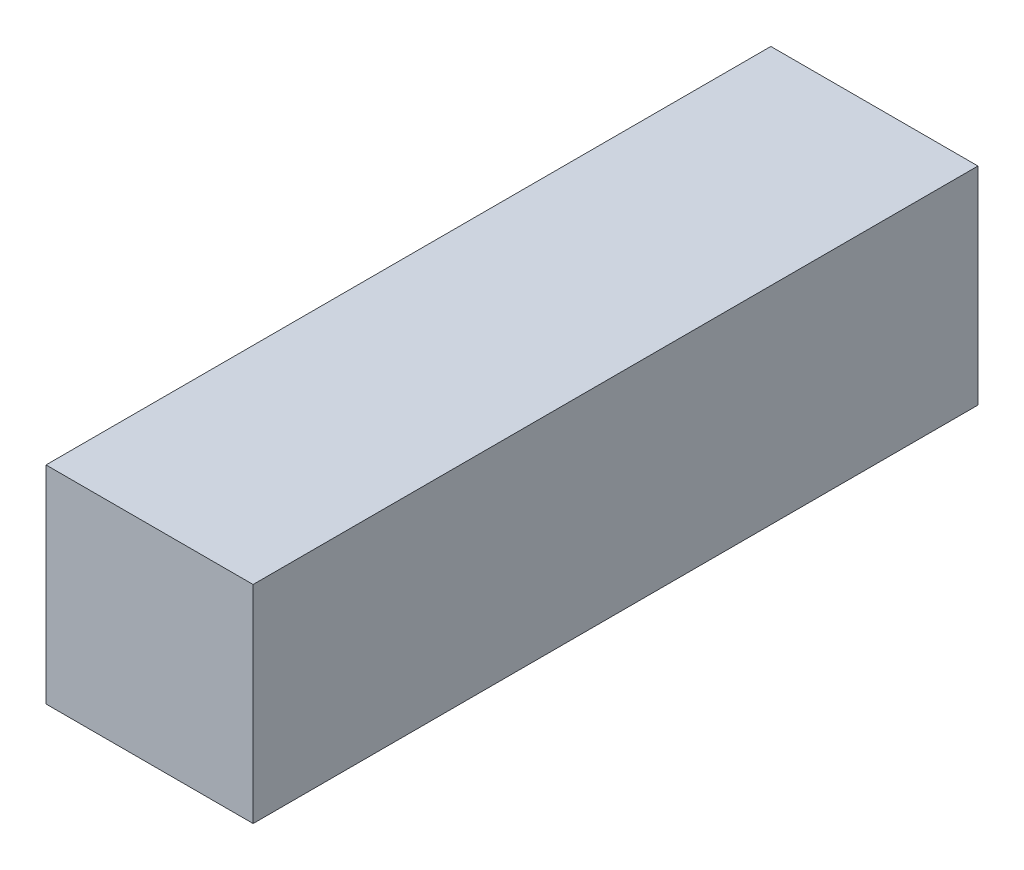
ISO-10303-21;
HEADER;
FILE_DESCRIPTION(('STEP AP214'),'2;1');
FILE_NAME('part.step','',(''),(''),'','','');
FILE_SCHEMA(('AUTOMOTIVE_DESIGN { 1 0 10303 214 1 1 1 1 }'));
ENDSEC;
DATA;
#1=APPLICATION_CONTEXT('core data for automotive mechanical design processes');
#2=APPLICATION_PROTOCOL_DEFINITION('international standard','automotive_design',2000,#1);
#3=PRODUCT_CONTEXT('',#1,'mechanical');
#4=PRODUCT('Part','Part','',(#3));
#5=PRODUCT_RELATED_PRODUCT_CATEGORY('part','',(#4));
#6=PRODUCT_DEFINITION_FORMATION('','',#4);
#7=PRODUCT_DEFINITION_CONTEXT('part definition',#1,'design');
#8=PRODUCT_DEFINITION('design','',#6,#7);
#9=PRODUCT_DEFINITION_SHAPE('','',#8);
#10=(LENGTH_UNIT() NAMED_UNIT(*) SI_UNIT(.MILLI.,.METRE.));
#11=(NAMED_UNIT(*) PLANE_ANGLE_UNIT() SI_UNIT($,.RADIAN.));
#12=(NAMED_UNIT(*) SI_UNIT($,.STERADIAN.) SOLID_ANGLE_UNIT());
#13=UNCERTAINTY_MEASURE_WITH_UNIT(LENGTH_MEASURE(1.E-05),#10,'distance_accuracy_value','');
#14=(GEOMETRIC_REPRESENTATION_CONTEXT(3) GLOBAL_UNCERTAINTY_ASSIGNED_CONTEXT((#13)) GLOBAL_UNIT_ASSIGNED_CONTEXT((#10,
#11,#12)) REPRESENTATION_CONTEXT('',''));
#15=CARTESIAN_POINT('',(0.,0.,0.));
#16=DIRECTION('',(0.,0.,1.));
#17=DIRECTION('',(1.,0.,0.));
#18=AXIS2_PLACEMENT_3D('',#15,#16,#17);
#19=CARTESIAN_POINT('',(0.09997693999999,0.09997440000001,0.));
#20=DIRECTION('',(0.,-1.,0.));
#21=DIRECTION('',(0.,0.,-1.));
#22=AXIS2_PLACEMENT_3D('',#19,#20,#21);
#23=PLANE('',#22);
#24=DIRECTION('',(0.,0.,1.));
#25=VECTOR('',#24,1.);
#26=CARTESIAN_POINT('',(-0.10002266,0.09997440000001,0.));
#27=LINE('',#26,#25);
#28=CARTESIAN_POINT('',(-0.10002266,0.09997440000001,0.));
#29=VERTEX_POINT('',#28);
#30=CARTESIAN_POINT('',(-0.10002266,0.09997440000001,0.70000114));
#31=VERTEX_POINT('',#30);
#32=EDGE_CURVE('E20',#29,#31,#27,.T.);
#33=ORIENTED_EDGE('',*,*,#32,.T.);
#34=DIRECTION('',(-1.,0.,0.));
#35=VECTOR('',#34,1.);
#36=CARTESIAN_POINT('',(-0.10002266,0.09997440000001,0.70000114));
#37=LINE('',#36,#35);
#38=CARTESIAN_POINT('',(0.0999769399999925,0.09997440000001,0.70000114));
#39=VERTEX_POINT('',#38);
#40=EDGE_CURVE('E55',#31,#39,#37,.F.);
#41=ORIENTED_EDGE('',*,*,#40,.T.);
#42=DIRECTION('',(0.,0.,1.));
#43=VECTOR('',#42,1.);
#44=CARTESIAN_POINT('',(0.0999769400000002,0.09997440000001,0.));
#45=LINE('',#44,#43);
#46=CARTESIAN_POINT('',(0.0999769399999925,0.09997440000001,0.));
#47=VERTEX_POINT('',#46);
#48=EDGE_CURVE('E74',#39,#47,#45,.F.);
#49=ORIENTED_EDGE('',*,*,#48,.T.);
#50=DIRECTION('',(-1.,0.,0.));
#51=VECTOR('',#50,1.);
#52=CARTESIAN_POINT('',(-0.10002266,0.09997440000001,0.));
#53=LINE('',#52,#51);
#54=EDGE_CURVE('E66',#29,#47,#53,.F.);
#55=ORIENTED_EDGE('',*,*,#54,.F.);
#56=EDGE_LOOP('',(#33,#41,#49,#55));
#57=FACE_BOUND('',#56,.T.);
#58=ADVANCED_FACE('F17',(#57),#23,.F.);
#59=CARTESIAN_POINT('',(-0.10002266,0.09997440000001,0.));
#60=DIRECTION('',(0.999999976681658,0.000215955279545926,0.));
#61=DIRECTION('',(-0.000215955279545926,0.999999976681658,0.));
#62=AXIS2_PLACEMENT_3D('',#59,#60,#61);
#63=PLANE('',#62);
#64=DIRECTION('',(0.,0.,1.));
#65=VECTOR('',#64,1.);
#66=CARTESIAN_POINT('',(-0.09997948,-0.09997440000001,0.));
#67=LINE('',#66,#65);
#68=CARTESIAN_POINT('',(-0.0999794799999971,-0.09997440000001,0.));
#69=VERTEX_POINT('',#68);
#70=CARTESIAN_POINT('',(-0.0999794799999971,-0.09997440000001,0.70000114));
#71=VERTEX_POINT('',#70);
#72=EDGE_CURVE('E72',#69,#71,#67,.T.);
#73=ORIENTED_EDGE('',*,*,#72,.T.);
#74=DIRECTION('',(-0.000215955279517165,0.999999976681658,0.));
#75=VECTOR('',#74,1.);
#76=CARTESIAN_POINT('',(-0.09997948,-0.09997440000001,0.70000114));
#77=LINE('',#76,#75);
#78=EDGE_CURVE('E62',#71,#31,#77,.T.);
#79=ORIENTED_EDGE('',*,*,#78,.T.);
#80=ORIENTED_EDGE('',*,*,#32,.F.);
#81=DIRECTION('',(-0.000215955279517165,0.999999976681658,0.));
#82=VECTOR('',#81,1.);
#83=CARTESIAN_POINT('',(-0.09997948,-0.09997440000001,0.));
#84=LINE('',#83,#82);
#85=EDGE_CURVE('E80',#69,#29,#84,.T.);
#86=ORIENTED_EDGE('',*,*,#85,.F.);
#87=EDGE_LOOP('',(#73,#79,#80,#86));
#88=FACE_BOUND('',#87,.T.);
#89=ADVANCED_FACE('F71',(#88),#63,.F.);
#90=CARTESIAN_POINT('',(-0.10002266,0.09997440000001,0.70000114));
#91=DIRECTION('',(0.,0.,-1.));
#92=DIRECTION('',(-1.,0.,0.));
#93=AXIS2_PLACEMENT_3D('',#90,#91,#92);
#94=PLANE('',#93);
#95=DIRECTION('',(-0.999999994838962,-0.000101597622113296,0.));
#96=VECTOR('',#95,1.);
#97=CARTESIAN_POINT('',(-0.09997948,-0.09997440000001,0.70000114));
#98=LINE('',#97,#96);
#99=CARTESIAN_POINT('',(0.1000252,-0.0999540800000014,0.70000114));
#100=VERTEX_POINT('',#99);
#101=EDGE_CURVE('E83',#71,#100,#98,.F.);
#102=ORIENTED_EDGE('',*,*,#101,.T.);
#103=DIRECTION('',(0.000241386312714678,-0.999999970866324,0.));
#104=VECTOR('',#103,1.);
#105=CARTESIAN_POINT('',(0.1000252,-0.09995408,0.70000114));
#106=LINE('',#105,#104);
#107=EDGE_CURVE('E64',#100,#39,#106,.F.);
#108=ORIENTED_EDGE('',*,*,#107,.T.);
#109=ORIENTED_EDGE('',*,*,#40,.F.);
#110=ORIENTED_EDGE('',*,*,#78,.F.);
#111=EDGE_LOOP('',(#102,#108,#109,#110));
#112=FACE_BOUND('',#111,.T.);
#113=ADVANCED_FACE('F60',(#112),#94,.F.);
#114=CARTESIAN_POINT('',(0.1000252,-0.09995408,0.));
#115=DIRECTION('',(-0.999999970866324,-0.000241386312714678,0.));
#116=DIRECTION('',(0.000241386312714678,-0.999999970866324,0.));
#117=AXIS2_PLACEMENT_3D('',#114,#115,#116);
#118=PLANE('',#117);
#119=ORIENTED_EDGE('',*,*,#48,.F.);
#120=ORIENTED_EDGE('',*,*,#107,.F.);
#121=DIRECTION('',(0.,0.,1.));
#122=VECTOR('',#121,1.);
#123=CARTESIAN_POINT('',(0.1000252,-0.0999540800000056,0.));
#124=LINE('',#123,#122);
#125=CARTESIAN_POINT('',(0.1000252,-0.0999540800000014,0.));
#126=VERTEX_POINT('',#125);
#127=EDGE_CURVE('E26',#100,#126,#124,.F.);
#128=ORIENTED_EDGE('',*,*,#127,.T.);
#129=DIRECTION('',(0.000241386312765425,-0.999999970866324,0.));
#130=VECTOR('',#129,1.);
#131=CARTESIAN_POINT('',(0.09997693999999,0.09997440000001,0.));
#132=LINE('',#131,#130);
#133=EDGE_CURVE('E34',#47,#126,#132,.T.);
#134=ORIENTED_EDGE('',*,*,#133,.F.);
#135=EDGE_LOOP('',(#119,#120,#128,#134));
#136=FACE_BOUND('',#135,.T.);
#137=ADVANCED_FACE('F88',(#136),#118,.F.);
#138=CARTESIAN_POINT('',(-0.10002266,0.09997440000001,0.));
#139=DIRECTION('',(0.,0.,-1.));
#140=DIRECTION('',(-1.,0.,0.));
#141=AXIS2_PLACEMENT_3D('',#138,#139,#140);
#142=PLANE('',#141);
#143=DIRECTION('',(-0.999999994838962,-0.000101597622113296,0.));
#144=VECTOR('',#143,1.);
#145=CARTESIAN_POINT('',(-0.09997948,-0.09997440000001,0.));
#146=LINE('',#145,#144);
#147=EDGE_CURVE('E11',#126,#69,#146,.T.);
#148=ORIENTED_EDGE('',*,*,#147,.T.);
#149=ORIENTED_EDGE('',*,*,#85,.T.);
#150=ORIENTED_EDGE('',*,*,#54,.T.);
#151=ORIENTED_EDGE('',*,*,#133,.T.);
#152=EDGE_LOOP('',(#148,#149,#150,#151));
#153=FACE_BOUND('',#152,.T.);
#154=ADVANCED_FACE('F91',(#153),#142,.T.);
#155=CARTESIAN_POINT('',(-0.09997948,-0.09997440000001,0.));
#156=DIRECTION('',(-0.000101597622113296,0.999999994838962,0.));
#157=DIRECTION('',(-0.999999994838962,-0.000101597622113296,0.));
#158=AXIS2_PLACEMENT_3D('',#155,#156,#157);
#159=PLANE('',#158);
#160=ORIENTED_EDGE('',*,*,#127,.F.);
#161=ORIENTED_EDGE('',*,*,#101,.F.);
#162=ORIENTED_EDGE('',*,*,#72,.F.);
#163=ORIENTED_EDGE('',*,*,#147,.F.);
#164=EDGE_LOOP('',(#160,#161,#162,#163));
#165=FACE_BOUND('',#164,.T.);
#166=ADVANCED_FACE('F90',(#165),#159,.F.);
#167=CLOSED_SHELL('',(#58,#89,#113,#137,#154,#166));
#168=MANIFOLD_SOLID_BREP('B1',#167);
#169=ADVANCED_BREP_SHAPE_REPRESENTATION('',(#18,#168),#14);
#170=SHAPE_DEFINITION_REPRESENTATION(#9,#169);
ENDSEC;
END-ISO-10303-21;
